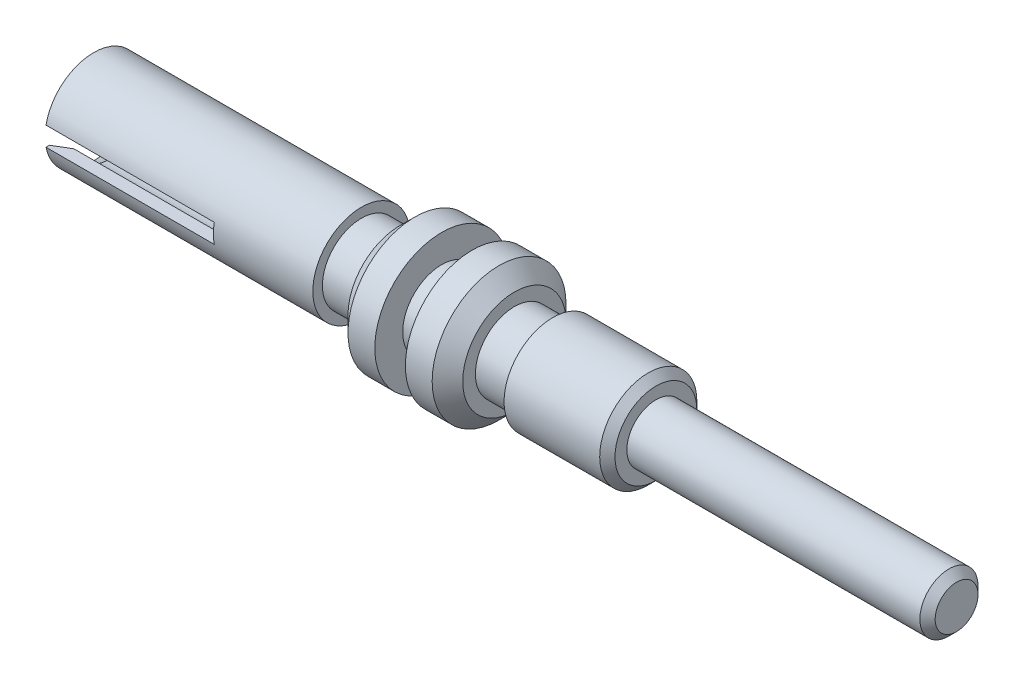
ISO-10303-21;
HEADER;
FILE_DESCRIPTION(('STEP AP214'),'2;1');
FILE_NAME('part.step','',(''),(''),'','','');
FILE_SCHEMA(('AUTOMOTIVE_DESIGN { 1 0 10303 214 1 1 1 1 }'));
ENDSEC;
DATA;
#1=APPLICATION_CONTEXT('core data for automotive mechanical design processes');
#2=APPLICATION_PROTOCOL_DEFINITION('international standard','automotive_design',2000,#1);
#3=PRODUCT_CONTEXT('',#1,'mechanical');
#4=PRODUCT('Part','Part','',(#3));
#5=PRODUCT_RELATED_PRODUCT_CATEGORY('part','',(#4));
#6=PRODUCT_DEFINITION_FORMATION('','',#4);
#7=PRODUCT_DEFINITION_CONTEXT('part definition',#1,'design');
#8=PRODUCT_DEFINITION('design','',#6,#7);
#9=PRODUCT_DEFINITION_SHAPE('','',#8);
#10=(LENGTH_UNIT() NAMED_UNIT(*) SI_UNIT(.MILLI.,.METRE.));
#11=(NAMED_UNIT(*) PLANE_ANGLE_UNIT() SI_UNIT($,.RADIAN.));
#12=(NAMED_UNIT(*) SI_UNIT($,.STERADIAN.) SOLID_ANGLE_UNIT());
#13=UNCERTAINTY_MEASURE_WITH_UNIT(LENGTH_MEASURE(1.E-05),#10,'distance_accuracy_value','');
#14=(GEOMETRIC_REPRESENTATION_CONTEXT(3) GLOBAL_UNCERTAINTY_ASSIGNED_CONTEXT((#13)) GLOBAL_UNIT_ASSIGNED_CONTEXT((#10,
#11,#12)) REPRESENTATION_CONTEXT('',''));
#15=CARTESIAN_POINT('',(0.,0.,0.));
#16=DIRECTION('',(0.,0.,1.));
#17=DIRECTION('',(1.,0.,0.));
#18=AXIS2_PLACEMENT_3D('',#15,#16,#17);
#19=CARTESIAN_POINT('',(0.,0.,0.));
#20=DIRECTION('',(1.,0.,0.));
#21=DIRECTION('',(0.,0.,-1.));
#22=AXIS2_PLACEMENT_3D('',#19,#20,#21);
#23=PLANE('',#22);
#24=CARTESIAN_POINT('',(0.,0.,0.));
#25=DIRECTION('',(1.,0.,0.));
#26=DIRECTION('',(0.,0.,-1.));
#27=AXIS2_PLACEMENT_3D('',#24,#25,#26);
#28=CIRCLE('',#27,0.279993380455116);
#29=CARTESIAN_POINT('',(0.,0.,-0.279993380455116));
#30=VERTEX_POINT('',#29);
#31=EDGE_CURVE('E20',#30,#30,#28,.F.);
#32=ORIENTED_EDGE('',*,*,#31,.F.);
#33=EDGE_LOOP('',(#32));
#34=FACE_BOUND('',#33,.T.);
#35=ADVANCED_FACE('F17',(#34),#23,.T.);
#36=CARTESIAN_POINT('',(-0.100005172498641,0.,0.));
#37=DIRECTION('',(-1.,0.,0.));
#38=DIRECTION('',(0.,-1.,0.));
#39=AXIS2_PLACEMENT_3D('',#36,#37,#38);
#40=CONICAL_SURFACE('',#39,0.379996188712539,0.785386342663054);
#41=ORIENTED_EDGE('',*,*,#31,.T.);
#42=EDGE_LOOP('',(#41));
#43=FACE_BOUND('',#42,.T.);
#44=CARTESIAN_POINT('',(-0.100008983876207,0.,0.));
#45=DIRECTION('',(-1.,0.,0.));
#46=DIRECTION('',(0.,-1.,0.));
#47=AXIS2_PLACEMENT_3D('',#44,#45,#46);
#48=CIRCLE('',#47,0.38);
#49=CARTESIAN_POINT('',(-0.100008983876207,-0.38,0.));
#50=VERTEX_POINT('',#49);
#51=EDGE_CURVE('E264',#50,#50,#48,.T.);
#52=ORIENTED_EDGE('',*,*,#51,.F.);
#53=EDGE_LOOP('',(#52));
#54=FACE_BOUND('',#53,.T.);
#55=ADVANCED_FACE('F271',(#43,#54),#40,.T.);
#56=CARTESIAN_POINT('',(-11.844,0.,0.));
#57=DIRECTION('',(1.,0.,0.));
#58=DIRECTION('',(0.,0.,-1.));
#59=AXIS2_PLACEMENT_3D('',#56,#57,#58);
#60=CYLINDRICAL_SURFACE('',#59,0.38);
#61=CARTESIAN_POINT('',(-3.93,0.,0.));
#62=DIRECTION('',(1.,0.,0.));
#63=DIRECTION('',(0.,0.,-1.));
#64=AXIS2_PLACEMENT_3D('',#61,#62,#63);
#65=CIRCLE('',#64,0.38);
#66=CARTESIAN_POINT('',(-3.93,0.,-0.38));
#67=VERTEX_POINT('',#66);
#68=EDGE_CURVE('E262',#67,#67,#65,.F.);
#69=ORIENTED_EDGE('',*,*,#68,.F.);
#70=EDGE_LOOP('',(#69));
#71=FACE_BOUND('',#70,.T.);
#72=ORIENTED_EDGE('',*,*,#51,.T.);
#73=EDGE_LOOP('',(#72));
#74=FACE_BOUND('',#73,.T.);
#75=ADVANCED_FACE('F279',(#71,#74),#60,.T.);
#76=CARTESIAN_POINT('',(-3.93,0.,0.));
#77=DIRECTION('',(1.,0.,0.));
#78=DIRECTION('',(0.,0.,-1.));
#79=AXIS2_PLACEMENT_3D('',#76,#77,#78);
#80=PLANE('',#79);
#81=ORIENTED_EDGE('',*,*,#68,.T.);
#82=EDGE_LOOP('',(#81));
#83=FACE_BOUND('',#82,.T.);
#84=CARTESIAN_POINT('',(-3.93,0.,0.));
#85=DIRECTION('',(1.,0.,0.));
#86=DIRECTION('',(0.,0.,-1.));
#87=AXIS2_PLACEMENT_3D('',#84,#85,#86);
#88=CIRCLE('',#87,0.534988909656758);
#89=CARTESIAN_POINT('',(-3.93,0.,-0.534988909656758));
#90=VERTEX_POINT('',#89);
#91=EDGE_CURVE('E259',#90,#90,#88,.F.);
#92=ORIENTED_EDGE('',*,*,#91,.F.);
#93=EDGE_LOOP('',(#92));
#94=FACE_BOUND('',#93,.T.);
#95=ADVANCED_FACE('F364',(#83,#94),#80,.T.);
#96=CARTESIAN_POINT('',(-4.03000722360503,0.,0.));
#97=DIRECTION('',(-1.,0.,0.));
#98=DIRECTION('',(0.,0.,1.));
#99=AXIS2_PLACEMENT_3D('',#96,#97,#98);
#100=CONICAL_SURFACE('',#99,0.634994060078498,0.785387798122323);
#101=ORIENTED_EDGE('',*,*,#91,.T.);
#102=EDGE_LOOP('',(#101));
#103=FACE_BOUND('',#102,.T.);
#104=CARTESIAN_POINT('',(-4.03001316364967,0.,0.));
#105=DIRECTION('',(-1.,0.,0.));
#106=DIRECTION('',(0.,0.,1.));
#107=AXIS2_PLACEMENT_3D('',#104,#105,#106);
#108=CIRCLE('',#107,0.635);
#109=CARTESIAN_POINT('',(-4.03001316364967,0.,0.635));
#110=VERTEX_POINT('',#109);
#111=EDGE_CURVE('E256',#110,#110,#108,.T.);
#112=ORIENTED_EDGE('',*,*,#111,.F.);
#113=EDGE_LOOP('',(#112));
#114=FACE_BOUND('',#113,.T.);
#115=ADVANCED_FACE('F360',(#103,#114),#100,.T.);
#116=CARTESIAN_POINT('',(-11.844,0.,0.));
#117=DIRECTION('',(1.,0.,0.));
#118=DIRECTION('',(0.,0.,-1.));
#119=AXIS2_PLACEMENT_3D('',#116,#117,#118);
#120=CYLINDRICAL_SURFACE('',#119,0.635);
#121=CARTESIAN_POINT('',(-5.28,0.,0.));
#122=DIRECTION('',(1.,0.,0.));
#123=DIRECTION('',(0.,0.,-1.));
#124=AXIS2_PLACEMENT_3D('',#121,#122,#123);
#125=CIRCLE('',#124,0.635);
#126=CARTESIAN_POINT('',(-5.28,0.,-0.635));
#127=VERTEX_POINT('',#126);
#128=EDGE_CURVE('E253',#127,#127,#125,.T.);
#129=ORIENTED_EDGE('',*,*,#128,.T.);
#130=EDGE_LOOP('',(#129));
#131=FACE_BOUND('',#130,.T.);
#132=ORIENTED_EDGE('',*,*,#111,.T.);
#133=EDGE_LOOP('',(#132));
#134=FACE_BOUND('',#133,.T.);
#135=ADVANCED_FACE('F356',(#131,#134),#120,.T.);
#136=CARTESIAN_POINT('',(-5.28,0.,0.));
#137=DIRECTION('',(1.,0.,0.));
#138=DIRECTION('',(0.,0.,-1.));
#139=AXIS2_PLACEMENT_3D('',#136,#137,#138);
#140=PLANE('',#139);
#141=CARTESIAN_POINT('',(-5.28,0.,0.));
#142=DIRECTION('',(1.,0.,0.));
#143=DIRECTION('',(0.,0.,-1.));
#144=AXIS2_PLACEMENT_3D('',#141,#142,#143);
#145=CIRCLE('',#144,0.51);
#146=CARTESIAN_POINT('',(-5.28,0.,-0.51));
#147=VERTEX_POINT('',#146);
#148=EDGE_CURVE('E250',#147,#147,#145,.F.);
#149=ORIENTED_EDGE('',*,*,#148,.F.);
#150=EDGE_LOOP('',(#149));
#151=FACE_BOUND('',#150,.T.);
#152=ORIENTED_EDGE('',*,*,#128,.F.);
#153=EDGE_LOOP('',(#152));
#154=FACE_BOUND('',#153,.T.);
#155=ADVANCED_FACE('F352',(#151,#154),#140,.F.);
#156=CARTESIAN_POINT('',(-11.844,0.,0.));
#157=DIRECTION('',(1.,0.,0.));
#158=DIRECTION('',(0.,0.,-1.));
#159=AXIS2_PLACEMENT_3D('',#156,#157,#158);
#160=CYLINDRICAL_SURFACE('',#159,0.51);
#161=CARTESIAN_POINT('',(-5.78,0.,0.));
#162=DIRECTION('',(1.,0.,0.));
#163=DIRECTION('',(0.,0.,-1.));
#164=AXIS2_PLACEMENT_3D('',#161,#162,#163);
#165=CIRCLE('',#164,0.51);
#166=CARTESIAN_POINT('',(-5.78,0.,-0.51));
#167=VERTEX_POINT('',#166);
#168=EDGE_CURVE('E247',#167,#167,#165,.F.);
#169=ORIENTED_EDGE('',*,*,#168,.F.);
#170=EDGE_LOOP('',(#169));
#171=FACE_BOUND('',#170,.T.);
#172=ORIENTED_EDGE('',*,*,#148,.T.);
#173=EDGE_LOOP('',(#172));
#174=FACE_BOUND('',#173,.T.);
#175=ADVANCED_FACE('F348',(#171,#174),#160,.T.);
#176=CARTESIAN_POINT('',(-5.78,0.,0.));
#177=DIRECTION('',(1.,0.,0.));
#178=DIRECTION('',(0.,0.,-1.));
#179=AXIS2_PLACEMENT_3D('',#176,#177,#178);
#180=PLANE('',#179);
#181=ORIENTED_EDGE('',*,*,#168,.T.);
#182=EDGE_LOOP('',(#181));
#183=FACE_BOUND('',#182,.T.);
#184=CARTESIAN_POINT('',(-5.78,0.,0.));
#185=DIRECTION('',(1.,0.,0.));
#186=DIRECTION('',(0.,0.,-1.));
#187=AXIS2_PLACEMENT_3D('',#184,#185,#186);
#188=CIRCLE('',#187,0.674993537485331);
#189=CARTESIAN_POINT('',(-5.78,0.,-0.674993537485331));
#190=VERTEX_POINT('',#189);
#191=EDGE_CURVE('E244',#190,#190,#188,.F.);
#192=ORIENTED_EDGE('',*,*,#191,.F.);
#193=EDGE_LOOP('',(#192));
#194=FACE_BOUND('',#193,.T.);
#195=ADVANCED_FACE('F344',(#183,#194),#180,.T.);
#196=CARTESIAN_POINT('',(-5.98000456221826,0.,0.));
#197=DIRECTION('',(-1.,0.,0.));
#198=DIRECTION('',(0.,0.,1.));
#199=AXIS2_PLACEMENT_3D('',#196,#197,#198);
#200=CONICAL_SURFACE('',#199,0.874996184847987,0.785393376344732);
#201=ORIENTED_EDGE('',*,*,#191,.T.);
#202=EDGE_LOOP('',(#201));
#203=FACE_BOUND('',#202,.T.);
#204=CARTESIAN_POINT('',(-5.9800083774068,0.,0.));
#205=DIRECTION('',(-1.,0.,0.));
#206=DIRECTION('',(0.,0.,1.));
#207=AXIS2_PLACEMENT_3D('',#204,#205,#206);
#208=CIRCLE('',#207,0.875);
#209=CARTESIAN_POINT('',(-5.9800083774068,0.,0.875));
#210=VERTEX_POINT('',#209);
#211=EDGE_CURVE('E241',#210,#210,#208,.T.);
#212=ORIENTED_EDGE('',*,*,#211,.F.);
#213=EDGE_LOOP('',(#212));
#214=FACE_BOUND('',#213,.T.);
#215=ADVANCED_FACE('F340',(#203,#214),#200,.T.);
#216=CARTESIAN_POINT('',(-11.844,0.,0.));
#217=DIRECTION('',(1.,0.,0.));
#218=DIRECTION('',(0.,0.,-1.));
#219=AXIS2_PLACEMENT_3D('',#216,#217,#218);
#220=CYLINDRICAL_SURFACE('',#219,0.875);
#221=CARTESIAN_POINT('',(-6.33,0.,0.));
#222=DIRECTION('',(1.,0.,0.));
#223=DIRECTION('',(0.,0.,-1.));
#224=AXIS2_PLACEMENT_3D('',#221,#222,#223);
#225=CIRCLE('',#224,0.875);
#226=CARTESIAN_POINT('',(-6.33,0.,-0.875));
#227=VERTEX_POINT('',#226);
#228=EDGE_CURVE('E238',#227,#227,#225,.T.);
#229=ORIENTED_EDGE('',*,*,#228,.T.);
#230=EDGE_LOOP('',(#229));
#231=FACE_BOUND('',#230,.T.);
#232=ORIENTED_EDGE('',*,*,#211,.T.);
#233=EDGE_LOOP('',(#232));
#234=FACE_BOUND('',#233,.T.);
#235=ADVANCED_FACE('F336',(#231,#234),#220,.T.);
#236=CARTESIAN_POINT('',(-6.33,0.,0.));
#237=DIRECTION('',(1.,0.,0.));
#238=DIRECTION('',(0.,0.,-1.));
#239=AXIS2_PLACEMENT_3D('',#236,#237,#238);
#240=PLANE('',#239);
#241=CARTESIAN_POINT('',(-6.33,0.,0.));
#242=DIRECTION('',(1.,0.,0.));
#243=DIRECTION('',(0.,0.,-1.));
#244=AXIS2_PLACEMENT_3D('',#241,#242,#243);
#245=CIRCLE('',#244,0.51);
#246=CARTESIAN_POINT('',(-6.33,0.,-0.51));
#247=VERTEX_POINT('',#246);
#248=EDGE_CURVE('E235',#247,#247,#245,.F.);
#249=ORIENTED_EDGE('',*,*,#248,.F.);
#250=EDGE_LOOP('',(#249));
#251=FACE_BOUND('',#250,.T.);
#252=ORIENTED_EDGE('',*,*,#228,.F.);
#253=EDGE_LOOP('',(#252));
#254=FACE_BOUND('',#253,.T.);
#255=ADVANCED_FACE('F332',(#251,#254),#240,.F.);
#256=CARTESIAN_POINT('',(-11.844,0.,0.));
#257=DIRECTION('',(1.,0.,0.));
#258=DIRECTION('',(0.,0.,-1.));
#259=AXIS2_PLACEMENT_3D('',#256,#257,#258);
#260=CYLINDRICAL_SURFACE('',#259,0.51);
#261=CARTESIAN_POINT('',(-6.73,0.,0.));
#262=DIRECTION('',(1.,0.,0.));
#263=DIRECTION('',(0.,0.,-1.));
#264=AXIS2_PLACEMENT_3D('',#261,#262,#263);
#265=CIRCLE('',#264,0.51);
#266=CARTESIAN_POINT('',(-6.73,0.,-0.51));
#267=VERTEX_POINT('',#266);
#268=EDGE_CURVE('E232',#267,#267,#265,.F.);
#269=ORIENTED_EDGE('',*,*,#268,.F.);
#270=EDGE_LOOP('',(#269));
#271=FACE_BOUND('',#270,.T.);
#272=ORIENTED_EDGE('',*,*,#248,.T.);
#273=EDGE_LOOP('',(#272));
#274=FACE_BOUND('',#273,.T.);
#275=ADVANCED_FACE('F326',(#271,#274),#260,.T.);
#276=CARTESIAN_POINT('',(-6.73,0.,0.));
#277=DIRECTION('',(1.,0.,0.));
#278=DIRECTION('',(0.,0.,-1.));
#279=AXIS2_PLACEMENT_3D('',#276,#277,#278);
#280=PLANE('',#279);
#281=ORIENTED_EDGE('',*,*,#268,.T.);
#282=EDGE_LOOP('',(#281));
#283=FACE_BOUND('',#282,.T.);
#284=CARTESIAN_POINT('',(-6.73,0.,0.));
#285=DIRECTION('',(1.,0.,0.));
#286=DIRECTION('',(0.,0.,-1.));
#287=AXIS2_PLACEMENT_3D('',#284,#285,#286);
#288=CIRCLE('',#287,0.875);
#289=CARTESIAN_POINT('',(-6.73,0.,-0.875));
#290=VERTEX_POINT('',#289);
#291=EDGE_CURVE('E229',#290,#290,#288,.F.);
#292=ORIENTED_EDGE('',*,*,#291,.F.);
#293=EDGE_LOOP('',(#292));
#294=FACE_BOUND('',#293,.T.);
#295=ADVANCED_FACE('F321',(#283,#294),#280,.T.);
#296=CARTESIAN_POINT('',(-11.844,0.,0.));
#297=DIRECTION('',(1.,0.,0.));
#298=DIRECTION('',(0.,0.,-1.));
#299=AXIS2_PLACEMENT_3D('',#296,#297,#298);
#300=CYLINDRICAL_SURFACE('',#299,0.875);
#301=ORIENTED_EDGE('',*,*,#291,.T.);
#302=EDGE_LOOP('',(#301));
#303=FACE_BOUND('',#302,.T.);
#304=CARTESIAN_POINT('',(-7.0799955647658,0.,0.));
#305=DIRECTION('',(1.,0.,0.));
#306=DIRECTION('',(0.,0.,-1.));
#307=AXIS2_PLACEMENT_3D('',#304,#305,#306);
#308=CIRCLE('',#307,0.874996500215275);
#309=CARTESIAN_POINT('',(-7.0799955647658,0.,-0.874996500215275));
#310=VERTEX_POINT('',#309);
#311=EDGE_CURVE('E130',#310,#310,#308,.F.);
#312=ORIENTED_EDGE('',*,*,#311,.F.);
#313=EDGE_LOOP('',(#312));
#314=FACE_BOUND('',#313,.T.);
#315=ADVANCED_FACE('F316',(#303,#314),#300,.T.);
#316=CARTESIAN_POINT('',(-11.2799999997719,0.,0.));
#317=DIRECTION('',(-1.,0.,0.));
#318=DIRECTION('',(0.,0.,1.));
#319=AXIS2_PLACEMENT_3D('',#316,#317,#318);
#320=CONICAL_SURFACE('',#319,0.59045443828154,0.523587324310848);
#321=CARTESIAN_POINT('',(-11.2799999999794,0.125,-0.577071437369604));
#322=CARTESIAN_POINT('',(-11.2466146711189,0.125,-0.557362760731988));
#323=CARTESIAN_POINT('',(-11.2132571567651,0.125,-0.537607268884686));
#324=CARTESIAN_POINT('',(-11.1465977428147,0.125,-0.498002646300726));
#325=CARTESIAN_POINT('',(-11.1132958432419,0.125,-0.478153515524019));
#326=CARTESIAN_POINT('',(-11.0800217581996,0.125,-0.458257569497579));
#327=B_SPLINE_CURVE_WITH_KNOTS('',3,(#321,#322,#323,#324,#325,#326),.UNSPECIFIED.,.F.,.F.,(4,2,
4),(0.,0.116305756512542,0.232611562772226),.UNSPECIFIED.);
#328=CARTESIAN_POINT('',(-11.2799999999893,0.125,-0.577071437375482));
#329=VERTEX_POINT('',#328);
#330=CARTESIAN_POINT('',(-11.0800217581875,0.125,-0.458257569493706));
#331=VERTEX_POINT('',#330);
#332=EDGE_CURVE('E129',#329,#331,#327,.T.);
#333=ORIENTED_EDGE('',*,*,#332,.T.);
#334=CARTESIAN_POINT('',(-11.0800217581755,0.,0.));
#335=DIRECTION('',(-1.,0.,0.));
#336=DIRECTION('',(0.,0.,-1.));
#337=AXIS2_PLACEMENT_3D('',#334,#335,#336);
#338=CIRCLE('',#337,0.474999999994452);
#339=CARTESIAN_POINT('',(-11.0800217581862,0.125,0.458257569492917));
#340=VERTEX_POINT('',#339);
#341=EDGE_CURVE('E123',#340,#331,#338,.T.);
#342=ORIENTED_EDGE('',*,*,#341,.F.);
#343=CARTESIAN_POINT('',(-11.0800217581964,0.125,0.458257569495677));
#344=CARTESIAN_POINT('',(-11.1132958432393,0.125,0.478153515522438));
#345=CARTESIAN_POINT('',(-11.1465977428126,0.125,0.498002646299464));
#346=CARTESIAN_POINT('',(-11.213257156764,0.125,0.537607268884058));
#347=CARTESIAN_POINT('',(-11.2466146711184,0.125,0.557362760731675));
#348=CARTESIAN_POINT('',(-11.2799999999794,0.125,0.577071437369605));
#349=B_SPLINE_CURVE_WITH_KNOTS('',3,(#343,#344,#345,#346,#347,#348),.UNSPECIFIED.,.F.,.F.,(4,2,
4),(0.,0.116305806261538,0.232611562775931),.UNSPECIFIED.);
#350=CARTESIAN_POINT('',(-11.2799999999893,0.125,0.577071437375482));
#351=VERTEX_POINT('',#350);
#352=EDGE_CURVE('E117',#340,#351,#349,.T.);
#353=ORIENTED_EDGE('',*,*,#352,.T.);
#354=CARTESIAN_POINT('',(-11.2799999999993,0.,0.));
#355=DIRECTION('',(-1.,0.,0.));
#356=DIRECTION('',(0.,0.,1.));
#357=AXIS2_PLACEMENT_3D('',#354,#355,#356);
#358=CIRCLE('',#357,0.590454438412811);
#359=EDGE_CURVE('E112',#351,#329,#358,.T.);
#360=ORIENTED_EDGE('',*,*,#359,.T.);
#361=EDGE_LOOP('',(#333,#342,#353,#360));
#362=FACE_BOUND('',#361,.T.);
#363=ADVANCED_FACE('F205',(#362),#320,.F.);
#364=CARTESIAN_POINT('',(-7.0799955647658,0.,0.));
#365=DIRECTION('',(1.,0.,0.));
#366=DIRECTION('',(0.,1.,0.));
#367=AXIS2_PLACEMENT_3D('',#364,#365,#366);
#368=CONICAL_SURFACE('',#367,0.874996500215275,0.78539362901667);
#369=ORIENTED_EDGE('',*,*,#311,.T.);
#370=EDGE_LOOP('',(#369));
#371=FACE_BOUND('',#370,.T.);
#372=CARTESIAN_POINT('',(-7.28,0.,0.));
#373=DIRECTION('',(1.,0.,0.));
#374=DIRECTION('',(0.,0.,-1.));
#375=AXIS2_PLACEMENT_3D('',#372,#373,#374);
#376=CIRCLE('',#375,0.674993878765379);
#377=CARTESIAN_POINT('',(-7.28,0.,-0.67499387876538));
#378=VERTEX_POINT('',#377);
#379=EDGE_CURVE('E104',#378,#378,#376,.T.);
#380=ORIENTED_EDGE('',*,*,#379,.T.);
#381=EDGE_LOOP('',(#380));
#382=FACE_BOUND('',#381,.T.);
#383=ADVANCED_FACE('F308',(#371,#382),#368,.T.);
#384=CARTESIAN_POINT('',(-8.37999999993144,0.,0.));
#385=DIRECTION('',(-1.,0.,0.));
#386=DIRECTION('',(0.,0.,1.));
#387=AXIS2_PLACEMENT_3D('',#384,#385,#386);
#388=CONICAL_SURFACE('',#387,0.474999999880765,1.04719755049893);
#389=CARTESIAN_POINT('',(-8.10575862215046,0.,-2.8421709430404E-10));
#390=VERTEX_POINT('',#389);
#391=VERTEX_LOOP('',#390);
#392=FACE_BOUND('',#391,.T.);
#393=CARTESIAN_POINT('',(-8.38,0.,0.));
#394=DIRECTION('',(1.,0.,0.));
#395=DIRECTION('',(0.,0.,-1.));
#396=AXIS2_PLACEMENT_3D('',#393,#394,#395);
#397=CIRCLE('',#396,0.475);
#398=CARTESIAN_POINT('',(-8.38,0.,-0.475));
#399=VERTEX_POINT('',#398);
#400=EDGE_CURVE('E133',#399,#399,#397,.F.);
#401=ORIENTED_EDGE('',*,*,#400,.T.);
#402=EDGE_LOOP('',(#401));
#403=FACE_BOUND('',#402,.T.);
#404=ADVANCED_FACE('F222',(#392,#403),#388,.F.);
#405=CARTESIAN_POINT('',(-11.28,0.125,1.082718863486));
#406=DIRECTION('',(0.,1.,0.));
#407=DIRECTION('',(0.,0.,1.));
#408=AXIS2_PLACEMENT_3D('',#405,#406,#407);
#409=PLANE('',#408);
#410=DIRECTION('',(1.,0.,0.));
#411=VECTOR('',#410,1.);
#412=CARTESIAN_POINT('',(-11.28,0.125,-0.458257569496));
#413=LINE('',#412,#411);
#414=CARTESIAN_POINT('',(-9.08,0.125,-0.458257569495792));
#415=VERTEX_POINT('',#414);
#416=EDGE_CURVE('E125',#331,#415,#413,.T.);
#417=ORIENTED_EDGE('',*,*,#416,.F.);
#418=ORIENTED_EDGE('',*,*,#332,.F.);
#419=DIRECTION('',(0.,0.,-1.));
#420=VECTOR('',#419,1.);
#421=CARTESIAN_POINT('',(-11.28,0.125,0.));
#422=LINE('',#421,#420);
#423=CARTESIAN_POINT('',(-11.28,0.124999999999994,-0.622575296650936));
#424=VERTEX_POINT('',#423);
#425=EDGE_CURVE('E557',#329,#424,#422,.T.);
#426=ORIENTED_EDGE('',*,*,#425,.T.);
#427=DIRECTION('',(1.,0.,0.));
#428=VECTOR('',#427,1.);
#429=CARTESIAN_POINT('',(-11.844,0.124999999999988,-0.622575296650938));
#430=LINE('',#429,#428);
#431=CARTESIAN_POINT('',(-9.08,0.124999999999994,-0.622575296650936));
#432=VERTEX_POINT('',#431);
#433=EDGE_CURVE('E194',#432,#424,#430,.F.);
#434=ORIENTED_EDGE('',*,*,#433,.F.);
#435=DIRECTION('',(0.,0.,1.));
#436=VECTOR('',#435,1.);
#437=CARTESIAN_POINT('',(-9.08,0.125,1.082718863486));
#438=LINE('',#437,#436);
#439=EDGE_CURVE('E128',#415,#432,#438,.F.);
#440=ORIENTED_EDGE('',*,*,#439,.F.);
#441=EDGE_LOOP('',(#417,#418,#426,#434,#440));
#442=FACE_BOUND('',#441,.T.);
#443=ADVANCED_FACE('F217',(#442),#409,.F.);
#444=CARTESIAN_POINT('',(-11.28,0.,0.));
#445=DIRECTION('',(1.,0.,0.));
#446=DIRECTION('',(0.,0.,-1.));
#447=AXIS2_PLACEMENT_3D('',#444,#445,#446);
#448=PLANE('',#447);
#449=DIRECTION('',(0.,0.,1.));
#450=VECTOR('',#449,1.);
#451=CARTESIAN_POINT('',(-11.28,0.125,1.082718863486));
#452=LINE('',#451,#450);
#453=CARTESIAN_POINT('',(-11.28,0.124999999999994,0.622575296650936));
#454=VERTEX_POINT('',#453);
#455=EDGE_CURVE('E119',#351,#454,#452,.T.);
#456=ORIENTED_EDGE('',*,*,#455,.T.);
#457=CARTESIAN_POINT('',(-11.28,0.,0.));
#458=DIRECTION('',(1.,0.,0.));
#459=DIRECTION('',(0.,0.,-1.));
#460=AXIS2_PLACEMENT_3D('',#457,#458,#459);
#461=CIRCLE('',#460,0.635);
#462=EDGE_CURVE('E191',#424,#454,#461,.T.);
#463=ORIENTED_EDGE('',*,*,#462,.F.);
#464=ORIENTED_EDGE('',*,*,#425,.F.);
#465=ORIENTED_EDGE('',*,*,#359,.F.);
#466=EDGE_LOOP('',(#456,#463,#464,#465));
#467=FACE_BOUND('',#466,.T.);
#468=ADVANCED_FACE('F214',(#467),#448,.F.);
#469=CARTESIAN_POINT('',(-11.28,0.125,1.082718863486));
#470=DIRECTION('',(0.,1.,0.));
#471=DIRECTION('',(0.,0.,1.));
#472=AXIS2_PLACEMENT_3D('',#469,#470,#471);
#473=PLANE('',#472);
#474=ORIENTED_EDGE('',*,*,#352,.F.);
#475=DIRECTION('',(1.,0.,0.));
#476=VECTOR('',#475,1.);
#477=CARTESIAN_POINT('',(-11.28,0.125,0.458257569496));
#478=LINE('',#477,#476);
#479=CARTESIAN_POINT('',(-9.08,0.125,0.458257569495792));
#480=VERTEX_POINT('',#479);
#481=EDGE_CURVE('E96',#480,#340,#478,.F.);
#482=ORIENTED_EDGE('',*,*,#481,.F.);
#483=DIRECTION('',(0.,0.,1.));
#484=VECTOR('',#483,1.);
#485=CARTESIAN_POINT('',(-9.08,0.125,1.082718863486));
#486=LINE('',#485,#484);
#487=CARTESIAN_POINT('',(-9.08,0.124999999999994,0.622575296650936));
#488=VERTEX_POINT('',#487);
#489=EDGE_CURVE('E107',#488,#480,#486,.F.);
#490=ORIENTED_EDGE('',*,*,#489,.F.);
#491=DIRECTION('',(1.,0.,0.));
#492=VECTOR('',#491,1.);
#493=CARTESIAN_POINT('',(-11.844,0.124999999999987,0.622575296650938));
#494=LINE('',#493,#492);
#495=EDGE_CURVE('E190',#454,#488,#494,.T.);
#496=ORIENTED_EDGE('',*,*,#495,.F.);
#497=ORIENTED_EDGE('',*,*,#455,.F.);
#498=EDGE_LOOP('',(#474,#482,#490,#496,#497));
#499=FACE_BOUND('',#498,.T.);
#500=ADVANCED_FACE('F115',(#499),#473,.F.);
#501=CARTESIAN_POINT('',(-7.28,0.,0.));
#502=DIRECTION('',(1.,0.,0.));
#503=DIRECTION('',(0.,0.,-1.));
#504=AXIS2_PLACEMENT_3D('',#501,#502,#503);
#505=PLANE('',#504);
#506=CARTESIAN_POINT('',(-7.28,0.,0.));
#507=DIRECTION('',(1.,0.,0.));
#508=DIRECTION('',(0.,0.,-1.));
#509=AXIS2_PLACEMENT_3D('',#506,#507,#508);
#510=CIRCLE('',#509,0.51);
#511=CARTESIAN_POINT('',(-7.28,0.,-0.51));
#512=VERTEX_POINT('',#511);
#513=EDGE_CURVE('E187',#512,#512,#510,.F.);
#514=ORIENTED_EDGE('',*,*,#513,.F.);
#515=EDGE_LOOP('',(#514));
#516=FACE_BOUND('',#515,.T.);
#517=ORIENTED_EDGE('',*,*,#379,.F.);
#518=EDGE_LOOP('',(#517));
#519=FACE_BOUND('',#518,.T.);
#520=ADVANCED_FACE('F213',(#516,#519),#505,.F.);
#521=CARTESIAN_POINT('',(-11.844,0.,0.));
#522=DIRECTION('',(1.,0.,0.));
#523=DIRECTION('',(0.,0.,-1.));
#524=AXIS2_PLACEMENT_3D('',#521,#522,#523);
#525=CYLINDRICAL_SURFACE('',#524,0.475);
#526=ORIENTED_EDGE('',*,*,#400,.F.);
#527=EDGE_LOOP('',(#526));
#528=FACE_BOUND('',#527,.T.);
#529=CARTESIAN_POINT('',(-9.08,0.,0.));
#530=DIRECTION('',(1.,0.,0.));
#531=DIRECTION('',(0.,0.,-1.));
#532=AXIS2_PLACEMENT_3D('',#529,#530,#531);
#533=CIRCLE('',#532,0.475);
#534=CARTESIAN_POINT('',(-9.08,-0.125,0.458257569495792));
#535=VERTEX_POINT('',#534);
#536=EDGE_CURVE('E92',#480,#535,#533,.T.);
#537=ORIENTED_EDGE('',*,*,#536,.F.);
#538=ORIENTED_EDGE('',*,*,#481,.T.);
#539=ORIENTED_EDGE('',*,*,#341,.T.);
#540=ORIENTED_EDGE('',*,*,#416,.T.);
#541=CARTESIAN_POINT('',(-9.08,0.,0.));
#542=DIRECTION('',(1.,0.,0.));
#543=DIRECTION('',(0.,0.,-1.));
#544=AXIS2_PLACEMENT_3D('',#541,#542,#543);
#545=CIRCLE('',#544,0.475);
#546=CARTESIAN_POINT('',(-9.08,-0.125,-0.458257569495792));
#547=VERTEX_POINT('',#546);
#548=EDGE_CURVE('E103',#547,#415,#545,.T.);
#549=ORIENTED_EDGE('',*,*,#548,.F.);
#550=DIRECTION('',(1.,0.,0.));
#551=VECTOR('',#550,1.);
#552=CARTESIAN_POINT('',(-11.28,-0.125,-0.458257569496));
#553=LINE('',#552,#551);
#554=CARTESIAN_POINT('',(-11.0800217581862,-0.125,-0.458257569492917));
#555=VERTEX_POINT('',#554);
#556=EDGE_CURVE('E158',#547,#555,#553,.F.);
#557=ORIENTED_EDGE('',*,*,#556,.T.);
#558=CARTESIAN_POINT('',(-11.0800217581755,0.,0.));
#559=DIRECTION('',(-1.,0.,0.));
#560=DIRECTION('',(0.,0.,-1.));
#561=AXIS2_PLACEMENT_3D('',#558,#559,#560);
#562=CIRCLE('',#561,0.474999999994452);
#563=CARTESIAN_POINT('',(-11.0800217581875,-0.125,0.458257569493706));
#564=VERTEX_POINT('',#563);
#565=EDGE_CURVE('E135',#555,#564,#562,.T.);
#566=ORIENTED_EDGE('',*,*,#565,.T.);
#567=DIRECTION('',(1.,0.,0.));
#568=VECTOR('',#567,1.);
#569=CARTESIAN_POINT('',(-11.28,-0.125,0.458257569496));
#570=LINE('',#569,#568);
#571=EDGE_CURVE('E99',#564,#535,#570,.T.);
#572=ORIENTED_EDGE('',*,*,#571,.T.);
#573=EDGE_LOOP('',(#537,#538,#539,#540,#549,#557,#566,#572));
#574=FACE_BOUND('',#573,.T.);
#575=ADVANCED_FACE('F94',(#528,#574),#525,.F.);
#576=CARTESIAN_POINT('',(-11.2799999997719,0.,0.));
#577=DIRECTION('',(-1.,0.,0.));
#578=DIRECTION('',(0.,0.,1.));
#579=AXIS2_PLACEMENT_3D('',#576,#577,#578);
#580=CONICAL_SURFACE('',#579,0.59045443828154,0.523587324310848);
#581=CARTESIAN_POINT('',(-11.2799999999794,-0.125,0.577071437369604));
#582=CARTESIAN_POINT('',(-11.2466146711189,-0.125,0.557362760731987));
#583=CARTESIAN_POINT('',(-11.2132571567651,-0.125,0.537607268884686));
#584=CARTESIAN_POINT('',(-11.1465977428147,-0.125,0.498002646300726));
#585=CARTESIAN_POINT('',(-11.1132958432419,-0.125,0.478153515524019));
#586=CARTESIAN_POINT('',(-11.0800217581996,-0.125,0.458257569497579));
#587=B_SPLINE_CURVE_WITH_KNOTS('',3,(#581,#582,#583,#584,#585,#586),.UNSPECIFIED.,.F.,.F.,(4,2,
4),(0.,0.11630575651254,0.232611562772222),.UNSPECIFIED.);
#588=CARTESIAN_POINT('',(-11.2799999999893,-0.125,0.577071437375481));
#589=VERTEX_POINT('',#588);
#590=EDGE_CURVE('E181',#589,#564,#587,.T.);
#591=ORIENTED_EDGE('',*,*,#590,.T.);
#592=ORIENTED_EDGE('',*,*,#565,.F.);
#593=CARTESIAN_POINT('',(-11.0800217581926,-0.125,-0.45825756949339));
#594=CARTESIAN_POINT('',(-11.1132958432366,-0.125,-0.478153515520855));
#595=CARTESIAN_POINT('',(-11.1465977428111,-0.125,-0.49800264629858));
#596=CARTESIAN_POINT('',(-11.2132571567649,-0.125,-0.537607268884567));
#597=CARTESIAN_POINT('',(-11.2466146711204,-0.125,-0.557362760732876));
#598=CARTESIAN_POINT('',(-11.2799999999826,-0.125,-0.577071437371496));
#599=B_SPLINE_CURVE_WITH_KNOTS('',3,(#593,#594,#595,#596,#597,#598),.UNSPECIFIED.,.F.,.F.,(4,2,
4),(0.,0.11630580626562,0.2326115627841),.UNSPECIFIED.);
#600=CARTESIAN_POINT('',(-11.2799999999909,-0.125,-0.577071437376427));
#601=VERTEX_POINT('',#600);
#602=EDGE_CURVE('E150',#555,#601,#599,.T.);
#603=ORIENTED_EDGE('',*,*,#602,.T.);
#604=CARTESIAN_POINT('',(-11.2799999999993,0.,0.));
#605=DIRECTION('',(-1.,0.,0.));
#606=DIRECTION('',(0.,0.,1.));
#607=AXIS2_PLACEMENT_3D('',#604,#605,#606);
#608=CIRCLE('',#607,0.590454438412811);
#609=EDGE_CURVE('E159',#601,#589,#608,.T.);
#610=ORIENTED_EDGE('',*,*,#609,.T.);
#611=EDGE_LOOP('',(#591,#592,#603,#610));
#612=FACE_BOUND('',#611,.T.);
#613=ADVANCED_FACE('F161',(#612),#580,.F.);
#614=CARTESIAN_POINT('',(-11.844,0.,0.));
#615=DIRECTION('',(1.,0.,0.));
#616=DIRECTION('',(0.,0.,-1.));
#617=AXIS2_PLACEMENT_3D('',#614,#615,#616);
#618=CYLINDRICAL_SURFACE('',#617,0.51);
#619=CARTESIAN_POINT('',(-7.78,0.,0.));
#620=DIRECTION('',(1.,0.,0.));
#621=DIRECTION('',(0.,0.,-1.));
#622=AXIS2_PLACEMENT_3D('',#619,#620,#621);
#623=CIRCLE('',#622,0.51);
#624=CARTESIAN_POINT('',(-7.78,0.,-0.51));
#625=VERTEX_POINT('',#624);
#626=EDGE_CURVE('E146',#625,#625,#623,.F.);
#627=ORIENTED_EDGE('',*,*,#626,.F.);
#628=EDGE_LOOP('',(#627));
#629=FACE_BOUND('',#628,.T.);
#630=ORIENTED_EDGE('',*,*,#513,.T.);
#631=EDGE_LOOP('',(#630));
#632=FACE_BOUND('',#631,.T.);
#633=ADVANCED_FACE('F179',(#629,#632),#618,.T.);
#634=CARTESIAN_POINT('',(-11.28,-0.125,-1.180010211789));
#635=DIRECTION('',(0.,-1.,0.));
#636=DIRECTION('',(0.,0.,-1.));
#637=AXIS2_PLACEMENT_3D('',#634,#635,#636);
#638=PLANE('',#637);
#639=DIRECTION('',(0.,0.,1.));
#640=VECTOR('',#639,1.);
#641=CARTESIAN_POINT('',(-9.08,-0.125,0.));
#642=LINE('',#641,#640);
#643=CARTESIAN_POINT('',(-9.08,-0.124999999999994,0.622575296650936));
#644=VERTEX_POINT('',#643);
#645=EDGE_CURVE('E149',#535,#644,#642,.T.);
#646=ORIENTED_EDGE('',*,*,#645,.F.);
#647=ORIENTED_EDGE('',*,*,#571,.F.);
#648=ORIENTED_EDGE('',*,*,#590,.F.);
#649=DIRECTION('',(0.,0.,-1.));
#650=VECTOR('',#649,1.);
#651=CARTESIAN_POINT('',(-11.28,-0.125,0.));
#652=LINE('',#651,#650);
#653=CARTESIAN_POINT('',(-11.28,-0.124999999999994,0.622575296650936));
#654=VERTEX_POINT('',#653);
#655=EDGE_CURVE('E546',#589,#654,#652,.F.);
#656=ORIENTED_EDGE('',*,*,#655,.T.);
#657=DIRECTION('',(1.,0.,0.));
#658=VECTOR('',#657,1.);
#659=CARTESIAN_POINT('',(-11.844,-0.124999999999987,0.622575296650938));
#660=LINE('',#659,#658);
#661=EDGE_CURVE('E145',#644,#654,#660,.F.);
#662=ORIENTED_EDGE('',*,*,#661,.F.);
#663=EDGE_LOOP('',(#646,#647,#648,#656,#662));
#664=FACE_BOUND('',#663,.T.);
#665=ADVANCED_FACE('F175',(#664),#638,.F.);
#666=CARTESIAN_POINT('',(-11.28,0.,0.));
#667=DIRECTION('',(1.,0.,0.));
#668=DIRECTION('',(0.,0.,-1.));
#669=AXIS2_PLACEMENT_3D('',#666,#667,#668);
#670=PLANE('',#669);
#671=ORIENTED_EDGE('',*,*,#655,.F.);
#672=ORIENTED_EDGE('',*,*,#609,.F.);
#673=DIRECTION('',(0.,0.,-1.));
#674=VECTOR('',#673,1.);
#675=CARTESIAN_POINT('',(-11.28,-0.125,-1.180010211789));
#676=LINE('',#675,#674);
#677=CARTESIAN_POINT('',(-11.28,-0.124999999999994,-0.622575296650936));
#678=VERTEX_POINT('',#677);
#679=EDGE_CURVE('E553',#601,#678,#676,.T.);
#680=ORIENTED_EDGE('',*,*,#679,.T.);
#681=CARTESIAN_POINT('',(-11.28,0.,0.));
#682=DIRECTION('',(1.,0.,0.));
#683=DIRECTION('',(0.,0.,-1.));
#684=AXIS2_PLACEMENT_3D('',#681,#682,#683);
#685=CIRCLE('',#684,0.635);
#686=EDGE_CURVE('E142',#654,#678,#685,.T.);
#687=ORIENTED_EDGE('',*,*,#686,.F.);
#688=EDGE_LOOP('',(#671,#672,#680,#687));
#689=FACE_BOUND('',#688,.T.);
#690=ADVANCED_FACE('F171',(#689),#670,.F.);
#691=CARTESIAN_POINT('',(-11.28,-0.125,-1.180010211789));
#692=DIRECTION('',(0.,-1.,0.));
#693=DIRECTION('',(0.,0.,-1.));
#694=AXIS2_PLACEMENT_3D('',#691,#692,#693);
#695=PLANE('',#694);
#696=ORIENTED_EDGE('',*,*,#556,.F.);
#697=DIRECTION('',(0.,0.,1.));
#698=VECTOR('',#697,1.);
#699=CARTESIAN_POINT('',(-9.08,-0.125,0.));
#700=LINE('',#699,#698);
#701=CARTESIAN_POINT('',(-9.08,-0.124999999999994,-0.622575296650936));
#702=VERTEX_POINT('',#701);
#703=EDGE_CURVE('E35',#702,#547,#700,.T.);
#704=ORIENTED_EDGE('',*,*,#703,.F.);
#705=DIRECTION('',(1.,0.,0.));
#706=VECTOR('',#705,1.);
#707=CARTESIAN_POINT('',(-11.844,-0.124999999999988,-0.622575296650938));
#708=LINE('',#707,#706);
#709=EDGE_CURVE('E141',#678,#702,#708,.T.);
#710=ORIENTED_EDGE('',*,*,#709,.F.);
#711=ORIENTED_EDGE('',*,*,#679,.F.);
#712=ORIENTED_EDGE('',*,*,#602,.F.);
#713=EDGE_LOOP('',(#696,#704,#710,#711,#712));
#714=FACE_BOUND('',#713,.T.);
#715=ADVANCED_FACE('F165',(#714),#695,.F.);
#716=CARTESIAN_POINT('',(-9.08,0.,0.));
#717=DIRECTION('',(-1.,0.,0.));
#718=DIRECTION('',(0.,0.,1.));
#719=AXIS2_PLACEMENT_3D('',#716,#717,#718);
#720=PLANE('',#719);
#721=ORIENTED_EDGE('',*,*,#439,.T.);
#722=CARTESIAN_POINT('',(-9.08,0.,0.));
#723=DIRECTION('',(1.,0.,0.));
#724=DIRECTION('',(0.,0.,-1.));
#725=AXIS2_PLACEMENT_3D('',#722,#723,#724);
#726=CIRCLE('',#725,0.635);
#727=EDGE_CURVE('E139',#702,#432,#726,.T.);
#728=ORIENTED_EDGE('',*,*,#727,.F.);
#729=ORIENTED_EDGE('',*,*,#703,.T.);
#730=ORIENTED_EDGE('',*,*,#548,.T.);
#731=EDGE_LOOP('',(#721,#728,#729,#730));
#732=FACE_BOUND('',#731,.T.);
#733=ADVANCED_FACE('F170',(#732),#720,.T.);
#734=CARTESIAN_POINT('',(-7.78,0.,0.));
#735=DIRECTION('',(1.,0.,0.));
#736=DIRECTION('',(0.,0.,-1.));
#737=AXIS2_PLACEMENT_3D('',#734,#735,#736);
#738=PLANE('',#737);
#739=ORIENTED_EDGE('',*,*,#626,.T.);
#740=EDGE_LOOP('',(#739));
#741=FACE_BOUND('',#740,.T.);
#742=CARTESIAN_POINT('',(-7.78,0.,0.));
#743=DIRECTION('',(1.,0.,0.));
#744=DIRECTION('',(0.,0.,-1.));
#745=AXIS2_PLACEMENT_3D('',#742,#743,#744);
#746=CIRCLE('',#745,0.635);
#747=CARTESIAN_POINT('',(-7.78,0.,-0.635));
#748=VERTEX_POINT('',#747);
#749=EDGE_CURVE('E26',#748,#748,#746,.F.);
#750=ORIENTED_EDGE('',*,*,#749,.F.);
#751=EDGE_LOOP('',(#750));
#752=FACE_BOUND('',#751,.T.);
#753=ADVANCED_FACE('F287',(#741,#752),#738,.T.);
#754=CARTESIAN_POINT('',(-9.08,0.,0.));
#755=DIRECTION('',(-1.,0.,0.));
#756=DIRECTION('',(0.,0.,1.));
#757=AXIS2_PLACEMENT_3D('',#754,#755,#756);
#758=PLANE('',#757);
#759=CARTESIAN_POINT('',(-9.08,0.,0.));
#760=DIRECTION('',(1.,0.,0.));
#761=DIRECTION('',(0.,0.,-1.));
#762=AXIS2_PLACEMENT_3D('',#759,#760,#761);
#763=CIRCLE('',#762,0.635);
#764=EDGE_CURVE('E11',#488,#644,#763,.T.);
#765=ORIENTED_EDGE('',*,*,#764,.F.);
#766=ORIENTED_EDGE('',*,*,#489,.T.);
#767=ORIENTED_EDGE('',*,*,#536,.T.);
#768=ORIENTED_EDGE('',*,*,#645,.T.);
#769=EDGE_LOOP('',(#765,#766,#767,#768));
#770=FACE_BOUND('',#769,.T.);
#771=ADVANCED_FACE('F108',(#770),#758,.T.);
#772=CARTESIAN_POINT('',(-11.844,0.,0.));
#773=DIRECTION('',(1.,0.,0.));
#774=DIRECTION('',(0.,0.,-1.));
#775=AXIS2_PLACEMENT_3D('',#772,#773,#774);
#776=CYLINDRICAL_SURFACE('',#775,0.635);
#777=ORIENTED_EDGE('',*,*,#749,.T.);
#778=EDGE_LOOP('',(#777));
#779=FACE_BOUND('',#778,.T.);
#780=ORIENTED_EDGE('',*,*,#495,.T.);
#781=ORIENTED_EDGE('',*,*,#764,.T.);
#782=ORIENTED_EDGE('',*,*,#661,.T.);
#783=ORIENTED_EDGE('',*,*,#686,.T.);
#784=ORIENTED_EDGE('',*,*,#709,.T.);
#785=ORIENTED_EDGE('',*,*,#727,.T.);
#786=ORIENTED_EDGE('',*,*,#433,.T.);
#787=ORIENTED_EDGE('',*,*,#462,.T.);
#788=EDGE_LOOP('',(#780,#781,#782,#783,#784,#785,#786,#787));
#789=FACE_BOUND('',#788,.T.);
#790=ADVANCED_FACE('F280',(#779,#789),#776,.T.);
#791=CLOSED_SHELL('',(#35,#55,#75,#95,#115,#135,#155,#175,#195,#215,#235,#255,#275,#295,#315,
#363,#383,#404,#443,#468,#500,#520,#575,#613,#633,#665,#690,#715,#733,#753,#771,#790));
#792=MANIFOLD_SOLID_BREP('B1',#791);
#793=ADVANCED_BREP_SHAPE_REPRESENTATION('',(#18,#792),#14);
#794=SHAPE_DEFINITION_REPRESENTATION(#9,#793);
ENDSEC;
END-ISO-10303-21;
